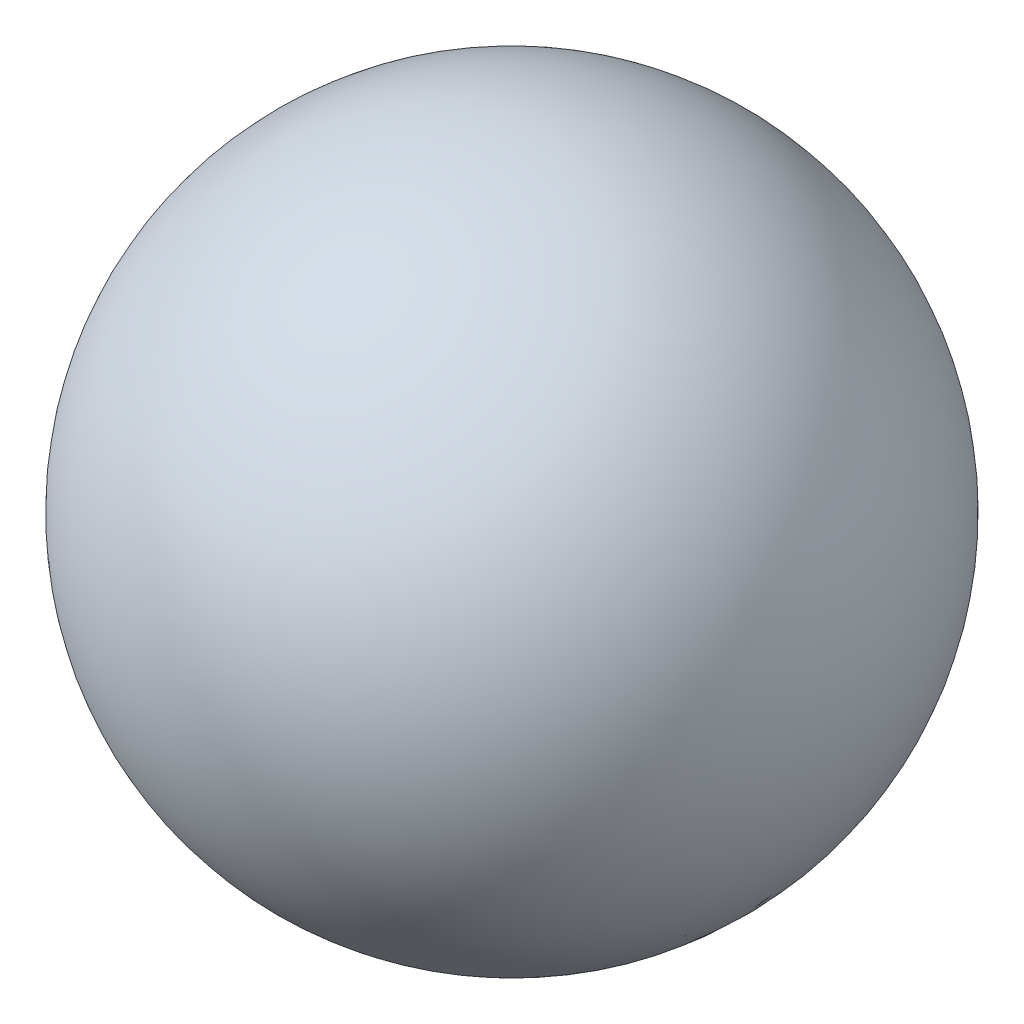
ISO-10303-21;
HEADER;
FILE_DESCRIPTION(('STEP AP214'),'2;1');
FILE_NAME('part.step','',(''),(''),'','','');
FILE_SCHEMA(('AUTOMOTIVE_DESIGN { 1 0 10303 214 1 1 1 1 }'));
ENDSEC;
DATA;
#1=APPLICATION_CONTEXT('core data for automotive mechanical design processes');
#2=APPLICATION_PROTOCOL_DEFINITION('international standard','automotive_design',2000,#1);
#3=PRODUCT_CONTEXT('',#1,'mechanical');
#4=PRODUCT('Part','Part','',(#3));
#5=PRODUCT_RELATED_PRODUCT_CATEGORY('part','',(#4));
#6=PRODUCT_DEFINITION_FORMATION('','',#4);
#7=PRODUCT_DEFINITION_CONTEXT('part definition',#1,'design');
#8=PRODUCT_DEFINITION('design','',#6,#7);
#9=PRODUCT_DEFINITION_SHAPE('','',#8);
#10=(LENGTH_UNIT() NAMED_UNIT(*) SI_UNIT(.MILLI.,.METRE.));
#11=(NAMED_UNIT(*) PLANE_ANGLE_UNIT() SI_UNIT($,.RADIAN.));
#12=(NAMED_UNIT(*) SI_UNIT($,.STERADIAN.) SOLID_ANGLE_UNIT());
#13=UNCERTAINTY_MEASURE_WITH_UNIT(LENGTH_MEASURE(1.E-05),#10,'distance_accuracy_value','');
#14=(GEOMETRIC_REPRESENTATION_CONTEXT(3) GLOBAL_UNCERTAINTY_ASSIGNED_CONTEXT((#13)) GLOBAL_UNIT_ASSIGNED_CONTEXT((#10,
#11,#12)) REPRESENTATION_CONTEXT('',''));
#15=CARTESIAN_POINT('',(0.,0.,0.));
#16=DIRECTION('',(0.,0.,1.));
#17=DIRECTION('',(1.,0.,0.));
#18=AXIS2_PLACEMENT_3D('',#15,#16,#17);
#19=CARTESIAN_POINT('',(0.,0.,0.));
#20=DIRECTION('',(0.644099649254035,0.102791432998624,0.758003669603861));
#21=DIRECTION('',(0.499566593445125,-0.806947855307862,-0.315068845695151));
#22=AXIS2_PLACEMENT_3D('',#19,#20,#21);
#23=SPHERICAL_SURFACE('',#22,1.1905);
#24=CARTESIAN_POINT('',(0.766800632436928,0.122373200984862,0.902403368663397));
#25=VERTEX_POINT('',#24);
#26=VERTEX_LOOP('',#25);
#27=FACE_BOUND('',#26,.T.);
#28=CARTESIAN_POINT('',(-0.766800632436928,-0.122373200984862,-0.902403368663396));
#29=VERTEX_POINT('',#28);
#30=VERTEX_LOOP('',#29);
#31=FACE_BOUND('',#30,.T.);
#32=ADVANCED_FACE('F15',(#27,#31),#23,.T.);
#33=CLOSED_SHELL('',(#32));
#34=MANIFOLD_SOLID_BREP('B1',#33);
#35=ADVANCED_BREP_SHAPE_REPRESENTATION('',(#18,#34),#14);
#36=SHAPE_DEFINITION_REPRESENTATION(#9,#35);
ENDSEC;
END-ISO-10303-21;
